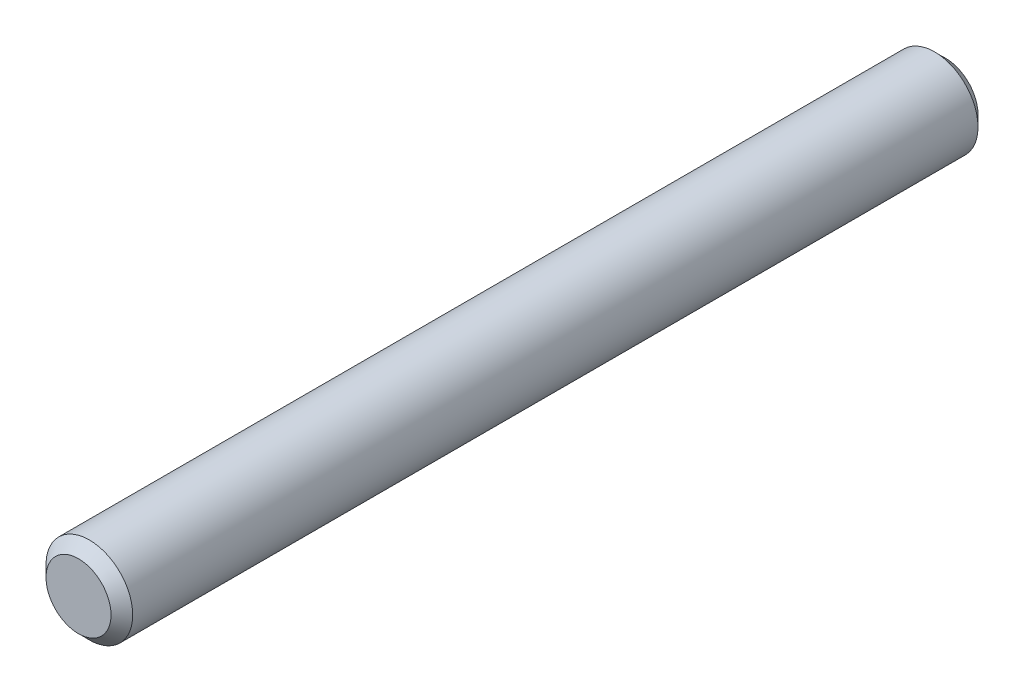
ISO-10303-21;
HEADER;
FILE_DESCRIPTION(('STEP AP214'),'2;1');
FILE_NAME('part.step','',(''),(''),'','','');
FILE_SCHEMA(('AUTOMOTIVE_DESIGN { 1 0 10303 214 1 1 1 1 }'));
ENDSEC;
DATA;
#1=APPLICATION_CONTEXT('core data for automotive mechanical design processes');
#2=APPLICATION_PROTOCOL_DEFINITION('international standard','automotive_design',2000,#1);
#3=PRODUCT_CONTEXT('',#1,'mechanical');
#4=PRODUCT('Part','Part','',(#3));
#5=PRODUCT_RELATED_PRODUCT_CATEGORY('part','',(#4));
#6=PRODUCT_DEFINITION_FORMATION('','',#4);
#7=PRODUCT_DEFINITION_CONTEXT('part definition',#1,'design');
#8=PRODUCT_DEFINITION('design','',#6,#7);
#9=PRODUCT_DEFINITION_SHAPE('','',#8);
#10=(LENGTH_UNIT() NAMED_UNIT(*) SI_UNIT(.MILLI.,.METRE.));
#11=(NAMED_UNIT(*) PLANE_ANGLE_UNIT() SI_UNIT($,.RADIAN.));
#12=(NAMED_UNIT(*) SI_UNIT($,.STERADIAN.) SOLID_ANGLE_UNIT());
#13=UNCERTAINTY_MEASURE_WITH_UNIT(LENGTH_MEASURE(1.E-05),#10,'distance_accuracy_value','');
#14=(GEOMETRIC_REPRESENTATION_CONTEXT(3) GLOBAL_UNCERTAINTY_ASSIGNED_CONTEXT((#13)) GLOBAL_UNIT_ASSIGNED_CONTEXT((#10,
#11,#12)) REPRESENTATION_CONTEXT('',''));
#15=CARTESIAN_POINT('',(0.,0.,0.));
#16=DIRECTION('',(0.,0.,1.));
#17=DIRECTION('',(1.,0.,0.));
#18=AXIS2_PLACEMENT_3D('',#15,#16,#17);
#19=CARTESIAN_POINT('',(0.,0.,80.));
#20=DIRECTION('',(0.,0.,-1.));
#21=DIRECTION('',(-1.,0.,0.));
#22=AXIS2_PLACEMENT_3D('',#19,#20,#21);
#23=CYLINDRICAL_SURFACE('',#22,4.);
#24=CARTESIAN_POINT('',(0.,0.,0.999999999999973));
#25=DIRECTION('',(0.,0.,1.));
#26=DIRECTION('',(1.,0.,0.));
#27=AXIS2_PLACEMENT_3D('',#24,#25,#26);
#28=CIRCLE('',#27,4.);
#29=CARTESIAN_POINT('',(4.,0.,0.999999999999973));
#30=VERTEX_POINT('',#29);
#31=EDGE_CURVE('E39',#30,#30,#28,.T.);
#32=ORIENTED_EDGE('',*,*,#31,.T.);
#33=EDGE_LOOP('',(#32));
#34=FACE_BOUND('',#33,.T.);
#35=CARTESIAN_POINT('',(0.,0.,79.));
#36=DIRECTION('',(0.,0.,1.));
#37=DIRECTION('',(1.,0.,0.));
#38=AXIS2_PLACEMENT_3D('',#35,#36,#37);
#39=CIRCLE('',#38,4.);
#40=CARTESIAN_POINT('',(4.,0.,79.));
#41=VERTEX_POINT('',#40);
#42=EDGE_CURVE('E43',#41,#41,#39,.F.);
#43=ORIENTED_EDGE('',*,*,#42,.T.);
#44=EDGE_LOOP('',(#43));
#45=FACE_BOUND('',#44,.T.);
#46=ADVANCED_FACE('F28',(#34,#45),#23,.T.);
#47=CARTESIAN_POINT('',(0.,0.,80.));
#48=DIRECTION('',(0.,0.,1.));
#49=DIRECTION('',(1.,0.,0.));
#50=AXIS2_PLACEMENT_3D('',#47,#48,#49);
#51=PLANE('',#50);
#52=CARTESIAN_POINT('',(0.,0.,80.));
#53=DIRECTION('',(0.,0.,1.));
#54=DIRECTION('',(1.,0.,0.));
#55=AXIS2_PLACEMENT_3D('',#52,#53,#54);
#56=CIRCLE('',#55,2.99999999999999);
#57=CARTESIAN_POINT('',(2.99999999999999,0.,80.));
#58=VERTEX_POINT('',#57);
#59=EDGE_CURVE('E10',#58,#58,#56,.T.);
#60=ORIENTED_EDGE('',*,*,#59,.T.);
#61=EDGE_LOOP('',(#60));
#62=FACE_BOUND('',#61,.T.);
#63=ADVANCED_FACE('F59',(#62),#51,.T.);
#64=CARTESIAN_POINT('',(0.,0.,0.));
#65=DIRECTION('',(0.,0.,1.));
#66=DIRECTION('',(1.,0.,0.));
#67=AXIS2_PLACEMENT_3D('',#64,#65,#66);
#68=PLANE('',#67);
#69=CARTESIAN_POINT('',(0.,0.,0.));
#70=DIRECTION('',(0.,0.,1.));
#71=DIRECTION('',(1.,0.,0.));
#72=AXIS2_PLACEMENT_3D('',#69,#70,#71);
#73=CIRCLE('',#72,3.00000000000002);
#74=CARTESIAN_POINT('',(3.00000000000002,0.,0.));
#75=VERTEX_POINT('',#74);
#76=EDGE_CURVE('E35',#75,#75,#73,.F.);
#77=ORIENTED_EDGE('',*,*,#76,.T.);
#78=EDGE_LOOP('',(#77));
#79=FACE_BOUND('',#78,.T.);
#80=ADVANCED_FACE('F56',(#79),#68,.F.);
#81=CARTESIAN_POINT('',(0.,0.,0.999999999999973));
#82=DIRECTION('',(0.,0.,1.));
#83=DIRECTION('',(1.,0.,0.));
#84=AXIS2_PLACEMENT_3D('',#81,#82,#83);
#85=CONICAL_SURFACE('',#84,4.,0.785398163397453);
#86=ORIENTED_EDGE('',*,*,#76,.F.);
#87=EDGE_LOOP('',(#86));
#88=FACE_BOUND('',#87,.T.);
#89=ORIENTED_EDGE('',*,*,#31,.F.);
#90=EDGE_LOOP('',(#89));
#91=FACE_BOUND('',#90,.T.);
#92=ADVANCED_FACE('F52',(#88,#91),#85,.T.);
#93=CARTESIAN_POINT('',(0.,0.,80.));
#94=DIRECTION('',(0.,0.,-1.));
#95=DIRECTION('',(-1.,0.,0.));
#96=AXIS2_PLACEMENT_3D('',#93,#94,#95);
#97=CONICAL_SURFACE('',#96,2.99999999999999,0.785398163397453);
#98=ORIENTED_EDGE('',*,*,#42,.F.);
#99=EDGE_LOOP('',(#98));
#100=FACE_BOUND('',#99,.T.);
#101=ORIENTED_EDGE('',*,*,#59,.F.);
#102=EDGE_LOOP('',(#101));
#103=FACE_BOUND('',#102,.T.);
#104=ADVANCED_FACE('F30',(#100,#103),#97,.T.);
#105=CLOSED_SHELL('',(#46,#63,#80,#92,#104));
#106=MANIFOLD_SOLID_BREP('B2',#105);
#107=ADVANCED_BREP_SHAPE_REPRESENTATION('',(#18,#106),#14);
#108=SHAPE_DEFINITION_REPRESENTATION(#9,#107);
ENDSEC;
END-ISO-10303-21;
